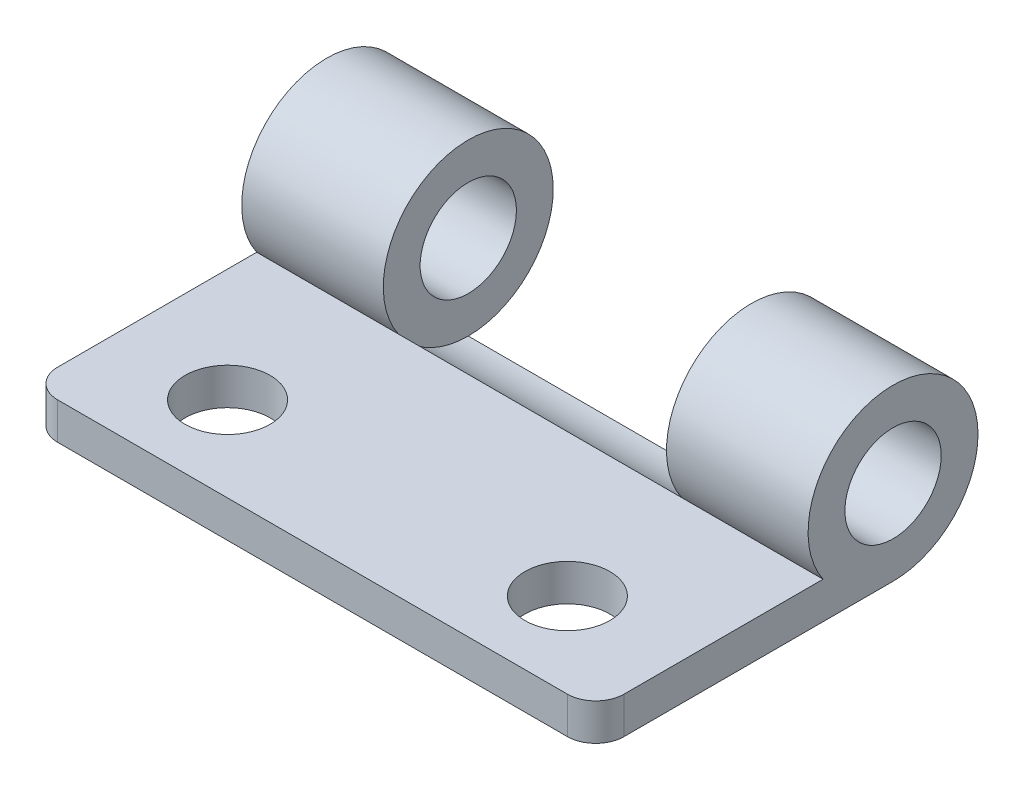
ISO-10303-21;
HEADER;
FILE_DESCRIPTION(('STEP AP214'),'2;1');
FILE_NAME('part.step','',(''),(''),'','','');
FILE_SCHEMA(('AUTOMOTIVE_DESIGN { 1 0 10303 214 1 1 1 1 }'));
ENDSEC;
DATA;
#1=APPLICATION_CONTEXT('core data for automotive mechanical design processes');
#2=APPLICATION_PROTOCOL_DEFINITION('international standard','automotive_design',2000,#1);
#3=PRODUCT_CONTEXT('',#1,'mechanical');
#4=PRODUCT('Part','Part','',(#3));
#5=PRODUCT_RELATED_PRODUCT_CATEGORY('part','',(#4));
#6=PRODUCT_DEFINITION_FORMATION('','',#4);
#7=PRODUCT_DEFINITION_CONTEXT('part definition',#1,'design');
#8=PRODUCT_DEFINITION('design','',#6,#7);
#9=PRODUCT_DEFINITION_SHAPE('','',#8);
#10=(LENGTH_UNIT() NAMED_UNIT(*) SI_UNIT(.MILLI.,.METRE.));
#11=(NAMED_UNIT(*) PLANE_ANGLE_UNIT() SI_UNIT($,.RADIAN.));
#12=(NAMED_UNIT(*) SI_UNIT($,.STERADIAN.) SOLID_ANGLE_UNIT());
#13=UNCERTAINTY_MEASURE_WITH_UNIT(LENGTH_MEASURE(1.E-05),#10,'distance_accuracy_value','');
#14=(GEOMETRIC_REPRESENTATION_CONTEXT(3) GLOBAL_UNCERTAINTY_ASSIGNED_CONTEXT((#13)) GLOBAL_UNIT_ASSIGNED_CONTEXT((#10,
#11,#12)) REPRESENTATION_CONTEXT('',''));
#15=CARTESIAN_POINT('',(0.,0.,0.));
#16=DIRECTION('',(0.,0.,1.));
#17=DIRECTION('',(1.,0.,0.));
#18=AXIS2_PLACEMENT_3D('',#15,#16,#17);
#19=CARTESIAN_POINT('',(20.,1.3,0.));
#20=DIRECTION('',(0.,-1.,0.));
#21=DIRECTION('',(0.,0.,-1.));
#22=AXIS2_PLACEMENT_3D('',#19,#20,#21);
#23=PLANE('',#22);
#24=CARTESIAN_POINT('',(16.,1.3,-3.));
#25=DIRECTION('',(0.,-1.,0.));
#26=DIRECTION('',(0.,0.,1.));
#27=AXIS2_PLACEMENT_3D('',#24,#25,#26);
#28=CIRCLE('',#27,1.5);
#29=CARTESIAN_POINT('',(16.,1.3,-1.5));
#30=VERTEX_POINT('',#29);
#31=EDGE_CURVE('E177',#30,#30,#28,.T.);
#32=ORIENTED_EDGE('',*,*,#31,.T.);
#33=EDGE_LOOP('',(#32));
#34=FACE_BOUND('',#33,.T.);
#35=CARTESIAN_POINT('',(4.,1.3,-3.));
#36=DIRECTION('',(0.,1.,0.));
#37=DIRECTION('',(0.,0.,1.));
#38=AXIS2_PLACEMENT_3D('',#35,#36,#37);
#39=CIRCLE('',#38,1.5);
#40=CARTESIAN_POINT('',(4.,1.3,-1.5));
#41=VERTEX_POINT('',#40);
#42=EDGE_CURVE('E173',#41,#41,#39,.T.);
#43=ORIENTED_EDGE('',*,*,#42,.F.);
#44=EDGE_LOOP('',(#43));
#45=FACE_BOUND('',#44,.T.);
#46=DIRECTION('',(-1.,0.,0.));
#47=VECTOR('',#46,1.);
#48=CARTESIAN_POINT('',(20.,1.3,0.));
#49=LINE('',#48,#47);
#50=CARTESIAN_POINT('',(19.,1.3,0.));
#51=VERTEX_POINT('',#50);
#52=CARTESIAN_POINT('',(1.,1.3,0.));
#53=VERTEX_POINT('',#52);
#54=EDGE_CURVE('E124',#51,#53,#49,.T.);
#55=ORIENTED_EDGE('',*,*,#54,.F.);
#56=CARTESIAN_POINT('',(19.,1.3,-1.));
#57=DIRECTION('',(0.,-1.,0.));
#58=DIRECTION('',(0.,0.,-1.));
#59=AXIS2_PLACEMENT_3D('',#56,#57,#58);
#60=CIRCLE('',#59,1.);
#61=CARTESIAN_POINT('',(20.,1.3,-1.));
#62=VERTEX_POINT('',#61);
#63=EDGE_CURVE('E46',#51,#62,#60,.F.);
#64=ORIENTED_EDGE('',*,*,#63,.T.);
#65=DIRECTION('',(0.,0.,1.));
#66=VECTOR('',#65,1.);
#67=CARTESIAN_POINT('',(20.,1.3,0.));
#68=LINE('',#67,#66);
#69=CARTESIAN_POINT('',(20.,1.3,-8.02815858113834));
#70=VERTEX_POINT('',#69);
#71=EDGE_CURVE('E161',#70,#62,#68,.T.);
#72=ORIENTED_EDGE('',*,*,#71,.F.);
#73=DIRECTION('',(1.,0.,0.));
#74=VECTOR('',#73,1.);
#75=CARTESIAN_POINT('',(15.,1.3,-8.02815858113834));
#76=LINE('',#75,#74);
#77=CARTESIAN_POINT('',(15.,1.3,-8.02815858113834));
#78=VERTEX_POINT('',#77);
#79=EDGE_CURVE('E114',#70,#78,#76,.F.);
#80=ORIENTED_EDGE('',*,*,#79,.T.);
#81=DIRECTION('',(1.,0.,0.));
#82=VECTOR('',#81,1.);
#83=CARTESIAN_POINT('',(5.,1.3,-8.02815858113834));
#84=LINE('',#83,#82);
#85=CARTESIAN_POINT('',(5.,1.3,-8.02815858113834));
#86=VERTEX_POINT('',#85);
#87=EDGE_CURVE('E142',#86,#78,#84,.T.);
#88=ORIENTED_EDGE('',*,*,#87,.F.);
#89=DIRECTION('',(-1.,0.,0.));
#90=VECTOR('',#89,1.);
#91=CARTESIAN_POINT('',(5.,1.3,-8.02815858113834));
#92=LINE('',#91,#90);
#93=CARTESIAN_POINT('',(0.,1.3,-8.02815858113834));
#94=VERTEX_POINT('',#93);
#95=EDGE_CURVE('E131',#94,#86,#92,.F.);
#96=ORIENTED_EDGE('',*,*,#95,.F.);
#97=DIRECTION('',(0.,0.,1.));
#98=VECTOR('',#97,1.);
#99=CARTESIAN_POINT('',(0.,1.3,0.));
#100=LINE('',#99,#98);
#101=CARTESIAN_POINT('',(0.,1.3,-1.));
#102=VERTEX_POINT('',#101);
#103=EDGE_CURVE('E113',#94,#102,#100,.T.);
#104=ORIENTED_EDGE('',*,*,#103,.T.);
#105=CARTESIAN_POINT('',(1.,1.3,-1.));
#106=DIRECTION('',(0.,-1.,0.));
#107=DIRECTION('',(0.,0.,-1.));
#108=AXIS2_PLACEMENT_3D('',#105,#106,#107);
#109=CIRCLE('',#108,1.);
#110=EDGE_CURVE('E58',#102,#53,#109,.F.);
#111=ORIENTED_EDGE('',*,*,#110,.T.);
#112=EDGE_LOOP('',(#55,#64,#72,#80,#88,#96,#104,#111));
#113=FACE_BOUND('',#112,.T.);
#114=ADVANCED_FACE('F38',(#34,#45,#113),#23,.F.);
#115=CARTESIAN_POINT('',(20.,0.,0.));
#116=DIRECTION('',(0.,0.,-1.));
#117=DIRECTION('',(-1.,0.,0.));
#118=AXIS2_PLACEMENT_3D('',#115,#116,#117);
#119=PLANE('',#118);
#120=DIRECTION('',(-1.,0.,0.));
#121=VECTOR('',#120,1.);
#122=CARTESIAN_POINT('',(20.,0.,0.));
#123=LINE('',#122,#121);
#124=CARTESIAN_POINT('',(19.,0.,0.));
#125=VERTEX_POINT('',#124);
#126=CARTESIAN_POINT('',(1.,0.,0.));
#127=VERTEX_POINT('',#126);
#128=EDGE_CURVE('E167',#125,#127,#123,.T.);
#129=ORIENTED_EDGE('',*,*,#128,.F.);
#130=DIRECTION('',(0.,-1.,0.));
#131=VECTOR('',#130,1.);
#132=CARTESIAN_POINT('',(19.,0.,0.));
#133=LINE('',#132,#131);
#134=EDGE_CURVE('E186',#125,#51,#133,.F.);
#135=ORIENTED_EDGE('',*,*,#134,.T.);
#136=ORIENTED_EDGE('',*,*,#54,.T.);
#137=DIRECTION('',(0.,-1.,0.));
#138=VECTOR('',#137,1.);
#139=CARTESIAN_POINT('',(1.,0.,0.));
#140=LINE('',#139,#138);
#141=EDGE_CURVE('E183',#53,#127,#140,.T.);
#142=ORIENTED_EDGE('',*,*,#141,.T.);
#143=EDGE_LOOP('',(#129,#135,#136,#142));
#144=FACE_BOUND('',#143,.T.);
#145=ADVANCED_FACE('F201',(#144),#119,.F.);
#146=CARTESIAN_POINT('',(20.,0.,0.));
#147=DIRECTION('',(0.,1.,0.));
#148=DIRECTION('',(0.,0.,1.));
#149=AXIS2_PLACEMENT_3D('',#146,#147,#148);
#150=PLANE('',#149);
#151=CARTESIAN_POINT('',(16.,0.,-3.));
#152=DIRECTION('',(0.,1.,0.));
#153=DIRECTION('',(0.,0.,1.));
#154=AXIS2_PLACEMENT_3D('',#151,#152,#153);
#155=CIRCLE('',#154,1.5);
#156=CARTESIAN_POINT('',(16.,0.,-1.5));
#157=VERTEX_POINT('',#156);
#158=EDGE_CURVE('E174',#157,#157,#155,.F.);
#159=ORIENTED_EDGE('',*,*,#158,.F.);
#160=EDGE_LOOP('',(#159));
#161=FACE_BOUND('',#160,.T.);
#162=CARTESIAN_POINT('',(4.,0.,-3.));
#163=DIRECTION('',(0.,1.,0.));
#164=DIRECTION('',(0.,0.,1.));
#165=AXIS2_PLACEMENT_3D('',#162,#163,#164);
#166=CIRCLE('',#165,1.5);
#167=CARTESIAN_POINT('',(4.,0.,-1.5));
#168=VERTEX_POINT('',#167);
#169=EDGE_CURVE('E170',#168,#168,#166,.T.);
#170=ORIENTED_EDGE('',*,*,#169,.T.);
#171=EDGE_LOOP('',(#170));
#172=FACE_BOUND('',#171,.T.);
#173=DIRECTION('',(0.,0.,-1.));
#174=VECTOR('',#173,1.);
#175=CARTESIAN_POINT('',(20.,0.,0.));
#176=LINE('',#175,#174);
#177=CARTESIAN_POINT('',(20.,0.,-1.));
#178=VERTEX_POINT('',#177);
#179=CARTESIAN_POINT('',(20.,0.,-10.5));
#180=VERTEX_POINT('',#179);
#181=EDGE_CURVE('E159',#178,#180,#176,.T.);
#182=ORIENTED_EDGE('',*,*,#181,.F.);
#183=CARTESIAN_POINT('',(19.,0.,-1.));
#184=DIRECTION('',(0.,1.,0.));
#185=DIRECTION('',(0.,0.,1.));
#186=AXIS2_PLACEMENT_3D('',#183,#184,#185);
#187=CIRCLE('',#186,1.);
#188=EDGE_CURVE('E181',#178,#125,#187,.F.);
#189=ORIENTED_EDGE('',*,*,#188,.T.);
#190=ORIENTED_EDGE('',*,*,#128,.T.);
#191=CARTESIAN_POINT('',(1.,0.,-1.));
#192=DIRECTION('',(0.,1.,0.));
#193=DIRECTION('',(0.,0.,1.));
#194=AXIS2_PLACEMENT_3D('',#191,#192,#193);
#195=CIRCLE('',#194,1.);
#196=CARTESIAN_POINT('',(0.,0.,-1.));
#197=VERTEX_POINT('',#196);
#198=EDGE_CURVE('E111',#127,#197,#195,.F.);
#199=ORIENTED_EDGE('',*,*,#198,.T.);
#200=DIRECTION('',(0.,0.,-1.));
#201=VECTOR('',#200,1.);
#202=CARTESIAN_POINT('',(0.,0.,0.));
#203=LINE('',#202,#201);
#204=CARTESIAN_POINT('',(0.,0.,-10.5));
#205=VERTEX_POINT('',#204);
#206=EDGE_CURVE('E103',#197,#205,#203,.T.);
#207=ORIENTED_EDGE('',*,*,#206,.T.);
#208=DIRECTION('',(-1.,0.,0.));
#209=VECTOR('',#208,1.);
#210=CARTESIAN_POINT('',(20.,0.,-10.5));
#211=LINE('',#210,#209);
#212=CARTESIAN_POINT('',(5.,0.,-10.5));
#213=VERTEX_POINT('',#212);
#214=EDGE_CURVE('E108',#213,#205,#211,.T.);
#215=ORIENTED_EDGE('',*,*,#214,.F.);
#216=CARTESIAN_POINT('',(15.,0.,-10.5));
#217=VERTEX_POINT('',#216);
#218=EDGE_CURVE('E123',#217,#213,#211,.T.);
#219=ORIENTED_EDGE('',*,*,#218,.F.);
#220=EDGE_CURVE('E126',#180,#217,#211,.T.);
#221=ORIENTED_EDGE('',*,*,#220,.F.);
#222=EDGE_LOOP('',(#182,#189,#190,#199,#207,#215,#219,#221));
#223=FACE_BOUND('',#222,.T.);
#224=ADVANCED_FACE('F106',(#161,#172,#223),#150,.F.);
#225=CARTESIAN_POINT('',(20.,0.,0.));
#226=DIRECTION('',(-1.,0.,0.));
#227=DIRECTION('',(0.,0.,1.));
#228=AXIS2_PLACEMENT_3D('',#225,#226,#227);
#229=PLANE('',#228);
#230=CARTESIAN_POINT('',(20.,3.,-10.5));
#231=DIRECTION('',(1.,0.,0.));
#232=DIRECTION('',(0.,0.,-1.));
#233=AXIS2_PLACEMENT_3D('',#230,#231,#232);
#234=CIRCLE('',#233,1.7);
#235=CARTESIAN_POINT('',(20.,3.,-12.2));
#236=VERTEX_POINT('',#235);
#237=EDGE_CURVE('E146',#236,#236,#234,.T.);
#238=ORIENTED_EDGE('',*,*,#237,.F.);
#239=EDGE_LOOP('',(#238));
#240=FACE_BOUND('',#239,.T.);
#241=ORIENTED_EDGE('',*,*,#71,.T.);
#242=DIRECTION('',(0.,-1.,0.));
#243=VECTOR('',#242,1.);
#244=CARTESIAN_POINT('',(20.,0.,-1.));
#245=LINE('',#244,#243);
#246=EDGE_CURVE('E169',#62,#178,#245,.T.);
#247=ORIENTED_EDGE('',*,*,#246,.T.);
#248=ORIENTED_EDGE('',*,*,#181,.T.);
#249=CARTESIAN_POINT('',(20.,3.,-10.5));
#250=DIRECTION('',(1.,0.,0.));
#251=DIRECTION('',(0.,0.,-1.));
#252=AXIS2_PLACEMENT_3D('',#249,#250,#251);
#253=CIRCLE('',#252,3.);
#254=EDGE_CURVE('E150',#180,#70,#253,.T.);
#255=ORIENTED_EDGE('',*,*,#254,.T.);
#256=EDGE_LOOP('',(#241,#247,#248,#255));
#257=FACE_BOUND('',#256,.T.);
#258=ADVANCED_FACE('F194',(#240,#257),#229,.F.);
#259=CARTESIAN_POINT('',(0.,0.,0.));
#260=DIRECTION('',(-1.,0.,0.));
#261=DIRECTION('',(0.,0.,1.));
#262=AXIS2_PLACEMENT_3D('',#259,#260,#261);
#263=PLANE('',#262);
#264=ORIENTED_EDGE('',*,*,#206,.F.);
#265=DIRECTION('',(0.,-1.,0.));
#266=VECTOR('',#265,1.);
#267=CARTESIAN_POINT('',(0.,1.3,-1.));
#268=LINE('',#267,#266);
#269=EDGE_CURVE('E11',#197,#102,#268,.F.);
#270=ORIENTED_EDGE('',*,*,#269,.T.);
#271=ORIENTED_EDGE('',*,*,#103,.F.);
#272=CARTESIAN_POINT('',(0.,3.,-10.5));
#273=DIRECTION('',(1.,0.,0.));
#274=DIRECTION('',(0.,0.,-1.));
#275=AXIS2_PLACEMENT_3D('',#272,#273,#274);
#276=CIRCLE('',#275,3.);
#277=EDGE_CURVE('E120',#205,#94,#276,.T.);
#278=ORIENTED_EDGE('',*,*,#277,.F.);
#279=EDGE_LOOP('',(#264,#270,#271,#278));
#280=FACE_BOUND('',#279,.T.);
#281=CARTESIAN_POINT('',(0.,3.,-10.5));
#282=DIRECTION('',(1.,0.,0.));
#283=DIRECTION('',(0.,0.,-1.));
#284=AXIS2_PLACEMENT_3D('',#281,#282,#283);
#285=CIRCLE('',#284,1.7);
#286=CARTESIAN_POINT('',(0.,3.,-12.2));
#287=VERTEX_POINT('',#286);
#288=EDGE_CURVE('E134',#287,#287,#285,.T.);
#289=ORIENTED_EDGE('',*,*,#288,.T.);
#290=EDGE_LOOP('',(#289));
#291=FACE_BOUND('',#290,.T.);
#292=ADVANCED_FACE('F127',(#280,#291),#263,.T.);
#293=CARTESIAN_POINT('',(15.,3.,-10.5));
#294=DIRECTION('',(1.,0.,0.));
#295=DIRECTION('',(0.,0.,-1.));
#296=AXIS2_PLACEMENT_3D('',#293,#294,#295);
#297=PLANE('',#296);
#298=CARTESIAN_POINT('',(15.,3.,-10.5));
#299=DIRECTION('',(1.,0.,0.));
#300=DIRECTION('',(0.,0.,-1.));
#301=AXIS2_PLACEMENT_3D('',#298,#299,#300);
#302=CIRCLE('',#301,1.7);
#303=CARTESIAN_POINT('',(15.,3.,-12.2));
#304=VERTEX_POINT('',#303);
#305=EDGE_CURVE('E147',#304,#304,#302,.T.);
#306=ORIENTED_EDGE('',*,*,#305,.T.);
#307=EDGE_LOOP('',(#306));
#308=FACE_BOUND('',#307,.T.);
#309=CARTESIAN_POINT('',(15.,3.,-10.5));
#310=DIRECTION('',(1.,0.,0.));
#311=DIRECTION('',(0.,0.,-1.));
#312=AXIS2_PLACEMENT_3D('',#309,#310,#311);
#313=CIRCLE('',#312,3.);
#314=EDGE_CURVE('E153',#217,#78,#313,.T.);
#315=ORIENTED_EDGE('',*,*,#314,.F.);
#316=CARTESIAN_POINT('',(15.,3.,-10.5));
#317=DIRECTION('',(-1.,0.,0.));
#318=DIRECTION('',(0.,0.,1.));
#319=AXIS2_PLACEMENT_3D('',#316,#317,#318);
#320=CIRCLE('',#319,3.);
#321=EDGE_CURVE('E139',#217,#78,#320,.T.);
#322=ORIENTED_EDGE('',*,*,#321,.T.);
#323=EDGE_LOOP('',(#315,#322));
#324=FACE_BOUND('',#323,.T.);
#325=ADVANCED_FACE('F261',(#308,#324),#297,.F.);
#326=CARTESIAN_POINT('',(15.,3.,-10.5));
#327=DIRECTION('',(1.,0.,0.));
#328=DIRECTION('',(0.,0.,-1.));
#329=AXIS2_PLACEMENT_3D('',#326,#327,#328);
#330=CYLINDRICAL_SURFACE('',#329,3.);
#331=ORIENTED_EDGE('',*,*,#220,.T.);
#332=ORIENTED_EDGE('',*,*,#314,.T.);
#333=ORIENTED_EDGE('',*,*,#79,.F.);
#334=ORIENTED_EDGE('',*,*,#254,.F.);
#335=EDGE_LOOP('',(#331,#332,#333,#334));
#336=FACE_BOUND('',#335,.T.);
#337=ADVANCED_FACE('F259',(#336),#330,.T.);
#338=CARTESIAN_POINT('',(15.,3.,-10.5));
#339=DIRECTION('',(1.,0.,0.));
#340=DIRECTION('',(0.,0.,-1.));
#341=AXIS2_PLACEMENT_3D('',#338,#339,#340);
#342=CYLINDRICAL_SURFACE('',#341,1.7);
#343=ORIENTED_EDGE('',*,*,#237,.T.);
#344=EDGE_LOOP('',(#343));
#345=FACE_BOUND('',#344,.T.);
#346=ORIENTED_EDGE('',*,*,#305,.F.);
#347=EDGE_LOOP('',(#346));
#348=FACE_BOUND('',#347,.T.);
#349=ADVANCED_FACE('F252',(#345,#348),#342,.F.);
#350=CARTESIAN_POINT('',(5.,3.,-10.5));
#351=DIRECTION('',(-1.,0.,0.));
#352=DIRECTION('',(0.,0.,1.));
#353=AXIS2_PLACEMENT_3D('',#350,#351,#352);
#354=PLANE('',#353);
#355=CARTESIAN_POINT('',(5.,3.,-10.5));
#356=DIRECTION('',(1.,0.,0.));
#357=DIRECTION('',(0.,0.,-1.));
#358=AXIS2_PLACEMENT_3D('',#355,#356,#357);
#359=CIRCLE('',#358,1.7);
#360=CARTESIAN_POINT('',(5.,3.,-12.2));
#361=VERTEX_POINT('',#360);
#362=EDGE_CURVE('E129',#361,#361,#359,.T.);
#363=ORIENTED_EDGE('',*,*,#362,.F.);
#364=EDGE_LOOP('',(#363));
#365=FACE_BOUND('',#364,.T.);
#366=CARTESIAN_POINT('',(5.,3.,-10.5));
#367=DIRECTION('',(1.,0.,0.));
#368=DIRECTION('',(0.,0.,-1.));
#369=AXIS2_PLACEMENT_3D('',#366,#367,#368);
#370=CIRCLE('',#369,3.);
#371=EDGE_CURVE('E122',#213,#86,#370,.T.);
#372=ORIENTED_EDGE('',*,*,#371,.T.);
#373=CARTESIAN_POINT('',(5.,3.,-10.5));
#374=DIRECTION('',(-1.,0.,0.));
#375=DIRECTION('',(0.,0.,1.));
#376=AXIS2_PLACEMENT_3D('',#373,#374,#375);
#377=CIRCLE('',#376,3.);
#378=EDGE_CURVE('E140',#213,#86,#377,.T.);
#379=ORIENTED_EDGE('',*,*,#378,.F.);
#380=EDGE_LOOP('',(#372,#379));
#381=FACE_BOUND('',#380,.T.);
#382=ADVANCED_FACE('F249',(#365,#381),#354,.F.);
#383=CARTESIAN_POINT('',(5.,3.,-10.5));
#384=DIRECTION('',(1.,0.,0.));
#385=DIRECTION('',(0.,0.,-1.));
#386=AXIS2_PLACEMENT_3D('',#383,#384,#385);
#387=CYLINDRICAL_SURFACE('',#386,3.);
#388=ORIENTED_EDGE('',*,*,#218,.T.);
#389=ORIENTED_EDGE('',*,*,#378,.T.);
#390=ORIENTED_EDGE('',*,*,#87,.T.);
#391=ORIENTED_EDGE('',*,*,#321,.F.);
#392=EDGE_LOOP('',(#388,#389,#390,#391));
#393=FACE_BOUND('',#392,.T.);
#394=ADVANCED_FACE('F248',(#393),#387,.F.);
#395=CARTESIAN_POINT('',(5.,3.,-10.5));
#396=DIRECTION('',(-1.,0.,0.));
#397=DIRECTION('',(0.,0.,1.));
#398=AXIS2_PLACEMENT_3D('',#395,#396,#397);
#399=CYLINDRICAL_SURFACE('',#398,3.);
#400=ORIENTED_EDGE('',*,*,#277,.T.);
#401=ORIENTED_EDGE('',*,*,#95,.T.);
#402=ORIENTED_EDGE('',*,*,#371,.F.);
#403=ORIENTED_EDGE('',*,*,#214,.T.);
#404=EDGE_LOOP('',(#400,#401,#402,#403));
#405=FACE_BOUND('',#404,.T.);
#406=ADVANCED_FACE('F118',(#405),#399,.T.);
#407=CARTESIAN_POINT('',(5.,3.,-10.5));
#408=DIRECTION('',(-1.,0.,0.));
#409=DIRECTION('',(0.,0.,1.));
#410=AXIS2_PLACEMENT_3D('',#407,#408,#409);
#411=CYLINDRICAL_SURFACE('',#410,1.7);
#412=ORIENTED_EDGE('',*,*,#288,.F.);
#413=EDGE_LOOP('',(#412));
#414=FACE_BOUND('',#413,.T.);
#415=ORIENTED_EDGE('',*,*,#362,.T.);
#416=EDGE_LOOP('',(#415));
#417=FACE_BOUND('',#416,.T.);
#418=ADVANCED_FACE('F233',(#414,#417),#411,.F.);
#419=CARTESIAN_POINT('',(4.,-8.7,-3.));
#420=DIRECTION('',(0.,1.,0.));
#421=DIRECTION('',(0.,0.,1.));
#422=AXIS2_PLACEMENT_3D('',#419,#420,#421);
#423=CYLINDRICAL_SURFACE('',#422,1.5);
#424=ORIENTED_EDGE('',*,*,#42,.T.);
#425=EDGE_LOOP('',(#424));
#426=FACE_BOUND('',#425,.T.);
#427=ORIENTED_EDGE('',*,*,#169,.F.);
#428=EDGE_LOOP('',(#427));
#429=FACE_BOUND('',#428,.T.);
#430=ADVANCED_FACE('F231',(#426,#429),#423,.F.);
#431=CARTESIAN_POINT('',(16.,-8.7,-3.));
#432=DIRECTION('',(0.,1.,0.));
#433=DIRECTION('',(0.,0.,1.));
#434=AXIS2_PLACEMENT_3D('',#431,#432,#433);
#435=CYLINDRICAL_SURFACE('',#434,1.5);
#436=ORIENTED_EDGE('',*,*,#31,.F.);
#437=EDGE_LOOP('',(#436));
#438=FACE_BOUND('',#437,.T.);
#439=ORIENTED_EDGE('',*,*,#158,.T.);
#440=EDGE_LOOP('',(#439));
#441=FACE_BOUND('',#440,.T.);
#442=ADVANCED_FACE('F208',(#438,#441),#435,.F.);
#443=CARTESIAN_POINT('',(19.,0.,-1.));
#444=DIRECTION('',(0.,-1.,0.));
#445=DIRECTION('',(0.,0.,-1.));
#446=AXIS2_PLACEMENT_3D('',#443,#444,#445);
#447=CYLINDRICAL_SURFACE('',#446,1.);
#448=ORIENTED_EDGE('',*,*,#63,.F.);
#449=ORIENTED_EDGE('',*,*,#134,.F.);
#450=ORIENTED_EDGE('',*,*,#188,.F.);
#451=ORIENTED_EDGE('',*,*,#246,.F.);
#452=EDGE_LOOP('',(#448,#449,#450,#451));
#453=FACE_BOUND('',#452,.T.);
#454=ADVANCED_FACE('F197',(#453),#447,.T.);
#455=CARTESIAN_POINT('',(1.,0.,-1.));
#456=DIRECTION('',(0.,1.,0.));
#457=DIRECTION('',(0.,0.,1.));
#458=AXIS2_PLACEMENT_3D('',#455,#456,#457);
#459=CYLINDRICAL_SURFACE('',#458,1.);
#460=ORIENTED_EDGE('',*,*,#110,.F.);
#461=ORIENTED_EDGE('',*,*,#269,.F.);
#462=ORIENTED_EDGE('',*,*,#198,.F.);
#463=ORIENTED_EDGE('',*,*,#141,.F.);
#464=EDGE_LOOP('',(#460,#461,#462,#463));
#465=FACE_BOUND('',#464,.T.);
#466=ADVANCED_FACE('F40',(#465),#459,.T.);
#467=CLOSED_SHELL('',(#114,#145,#224,#258,#292,#325,#337,#349,#382,#394,#406,#418,#430,#442,
#454,#466));
#468=MANIFOLD_SOLID_BREP('B2',#467);
#469=ADVANCED_BREP_SHAPE_REPRESENTATION('',(#18,#468),#14);
#470=SHAPE_DEFINITION_REPRESENTATION(#9,#469);
ENDSEC;
END-ISO-10303-21;
